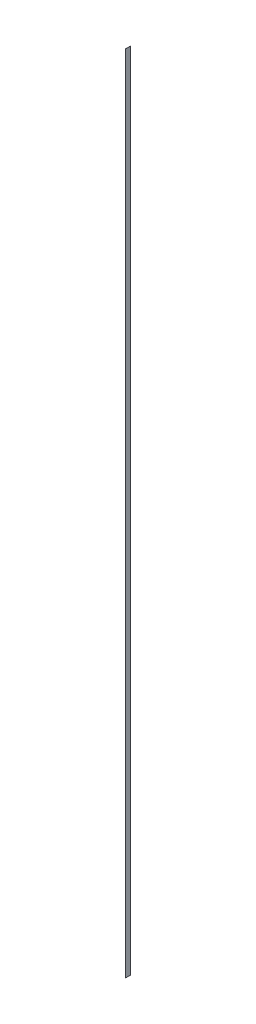
ISO-10303-21;
HEADER;
FILE_DESCRIPTION(('STEP AP214'),'2;1');
FILE_NAME('part.step','',(''),(''),'','','');
FILE_SCHEMA(('AUTOMOTIVE_DESIGN { 1 0 10303 214 1 1 1 1 }'));
ENDSEC;
DATA;
#1=APPLICATION_CONTEXT('core data for automotive mechanical design processes');
#2=APPLICATION_PROTOCOL_DEFINITION('international standard','automotive_design',2000,#1);
#3=PRODUCT_CONTEXT('',#1,'mechanical');
#4=PRODUCT('Part','Part','',(#3));
#5=PRODUCT_RELATED_PRODUCT_CATEGORY('part','',(#4));
#6=PRODUCT_DEFINITION_FORMATION('','',#4);
#7=PRODUCT_DEFINITION_CONTEXT('part definition',#1,'design');
#8=PRODUCT_DEFINITION('design','',#6,#7);
#9=PRODUCT_DEFINITION_SHAPE('','',#8);
#10=(LENGTH_UNIT() NAMED_UNIT(*) SI_UNIT(.MILLI.,.METRE.));
#11=(NAMED_UNIT(*) PLANE_ANGLE_UNIT() SI_UNIT($,.RADIAN.));
#12=(NAMED_UNIT(*) SI_UNIT($,.STERADIAN.) SOLID_ANGLE_UNIT());
#13=UNCERTAINTY_MEASURE_WITH_UNIT(LENGTH_MEASURE(1.E-05),#10,'distance_accuracy_value','');
#14=(GEOMETRIC_REPRESENTATION_CONTEXT(3) GLOBAL_UNCERTAINTY_ASSIGNED_CONTEXT((#13)) GLOBAL_UNIT_ASSIGNED_CONTEXT((#10,
#11,#12)) REPRESENTATION_CONTEXT('',''));
#15=CARTESIAN_POINT('',(0.,0.,0.));
#16=DIRECTION('',(0.,0.,1.));
#17=DIRECTION('',(1.,0.,0.));
#18=AXIS2_PLACEMENT_3D('',#15,#16,#17);
#19=CARTESIAN_POINT('',(1.27,0.,25.4));
#20=DIRECTION('',(0.,0.,-1.));
#21=DIRECTION('',(-1.,0.,0.));
#22=AXIS2_PLACEMENT_3D('',#19,#20,#21);
#23=PLANE('',#22);
#24=DIRECTION('',(0.,-1.,0.));
#25=VECTOR('',#24,1.);
#26=CARTESIAN_POINT('',(0.,0.,25.4));
#27=LINE('',#26,#25);
#28=CARTESIAN_POINT('',(0.,8229.6,25.4));
#29=VERTEX_POINT('',#28);
#30=CARTESIAN_POINT('',(0.,0.,25.4));
#31=VERTEX_POINT('',#30);
#32=EDGE_CURVE('E96',#29,#31,#27,.T.);
#33=ORIENTED_EDGE('',*,*,#32,.T.);
#34=DIRECTION('',(-1.,0.,0.));
#35=VECTOR('',#34,1.);
#36=CARTESIAN_POINT('',(1.27,0.,25.4));
#37=LINE('',#36,#35);
#38=CARTESIAN_POINT('',(1.27,0.,25.4));
#39=VERTEX_POINT('',#38);
#40=EDGE_CURVE('E11',#39,#31,#37,.T.);
#41=ORIENTED_EDGE('',*,*,#40,.F.);
#42=DIRECTION('',(0.,-1.,0.));
#43=VECTOR('',#42,1.);
#44=CARTESIAN_POINT('',(1.27,0.,25.4));
#45=LINE('',#44,#43);
#46=CARTESIAN_POINT('',(1.27,8229.6,25.4));
#47=VERTEX_POINT('',#46);
#48=EDGE_CURVE('E84',#47,#39,#45,.T.);
#49=ORIENTED_EDGE('',*,*,#48,.F.);
#50=DIRECTION('',(-1.,0.,0.));
#51=VECTOR('',#50,1.);
#52=CARTESIAN_POINT('',(1.27,8229.6,25.4));
#53=LINE('',#52,#51);
#54=EDGE_CURVE('E92',#47,#29,#53,.T.);
#55=ORIENTED_EDGE('',*,*,#54,.T.);
#56=EDGE_LOOP('',(#33,#41,#49,#55));
#57=FACE_BOUND('',#56,.T.);
#58=ADVANCED_FACE('F33',(#57),#23,.F.);
#59=CARTESIAN_POINT('',(1.27,0.,25.4));
#60=DIRECTION('',(0.,1.,0.));
#61=DIRECTION('',(0.,0.,1.));
#62=AXIS2_PLACEMENT_3D('',#59,#60,#61);
#63=PLANE('',#62);
#64=DIRECTION('',(0.,0.,-1.));
#65=VECTOR('',#64,1.);
#66=CARTESIAN_POINT('',(0.,0.,25.4));
#67=LINE('',#66,#65);
#68=CARTESIAN_POINT('',(0.,0.,-25.4));
#69=VERTEX_POINT('',#68);
#70=EDGE_CURVE('E88',#31,#69,#67,.T.);
#71=ORIENTED_EDGE('',*,*,#70,.T.);
#72=DIRECTION('',(-1.,0.,0.));
#73=VECTOR('',#72,1.);
#74=CARTESIAN_POINT('',(1.27,0.,-25.4));
#75=LINE('',#74,#73);
#76=CARTESIAN_POINT('',(1.27,0.,-25.4));
#77=VERTEX_POINT('',#76);
#78=EDGE_CURVE('E41',#77,#69,#75,.T.);
#79=ORIENTED_EDGE('',*,*,#78,.F.);
#80=DIRECTION('',(0.,0.,-1.));
#81=VECTOR('',#80,1.);
#82=CARTESIAN_POINT('',(1.27,0.,25.4));
#83=LINE('',#82,#81);
#84=EDGE_CURVE('E79',#39,#77,#83,.T.);
#85=ORIENTED_EDGE('',*,*,#84,.F.);
#86=ORIENTED_EDGE('',*,*,#40,.T.);
#87=EDGE_LOOP('',(#71,#79,#85,#86));
#88=FACE_BOUND('',#87,.T.);
#89=ADVANCED_FACE('F87',(#88),#63,.F.);
#90=CARTESIAN_POINT('',(1.27,0.,-25.4));
#91=DIRECTION('',(0.,0.,1.));
#92=DIRECTION('',(1.,0.,0.));
#93=AXIS2_PLACEMENT_3D('',#90,#91,#92);
#94=PLANE('',#93);
#95=DIRECTION('',(0.,1.,0.));
#96=VECTOR('',#95,1.);
#97=CARTESIAN_POINT('',(0.,0.,-25.4));
#98=LINE('',#97,#96);
#99=CARTESIAN_POINT('',(0.,8229.6,-25.4));
#100=VERTEX_POINT('',#99);
#101=EDGE_CURVE('E66',#69,#100,#98,.T.);
#102=ORIENTED_EDGE('',*,*,#101,.T.);
#103=DIRECTION('',(-1.,0.,0.));
#104=VECTOR('',#103,1.);
#105=CARTESIAN_POINT('',(1.27,8229.6,-25.4));
#106=LINE('',#105,#104);
#107=CARTESIAN_POINT('',(1.27,8229.6,-25.4));
#108=VERTEX_POINT('',#107);
#109=EDGE_CURVE('E89',#108,#100,#106,.T.);
#110=ORIENTED_EDGE('',*,*,#109,.F.);
#111=DIRECTION('',(0.,1.,0.));
#112=VECTOR('',#111,1.);
#113=CARTESIAN_POINT('',(1.27,0.,-25.4));
#114=LINE('',#113,#112);
#115=EDGE_CURVE('E82',#77,#108,#114,.T.);
#116=ORIENTED_EDGE('',*,*,#115,.F.);
#117=ORIENTED_EDGE('',*,*,#78,.T.);
#118=EDGE_LOOP('',(#102,#110,#116,#117));
#119=FACE_BOUND('',#118,.T.);
#120=ADVANCED_FACE('F90',(#119),#94,.F.);
#121=CARTESIAN_POINT('',(1.27,8229.6,25.4));
#122=DIRECTION('',(0.,-1.,0.));
#123=DIRECTION('',(0.,0.,-1.));
#124=AXIS2_PLACEMENT_3D('',#121,#122,#123);
#125=PLANE('',#124);
#126=DIRECTION('',(0.,0.,1.));
#127=VECTOR('',#126,1.);
#128=CARTESIAN_POINT('',(0.,8229.6,25.4));
#129=LINE('',#128,#127);
#130=EDGE_CURVE('E72',#100,#29,#129,.T.);
#131=ORIENTED_EDGE('',*,*,#130,.T.);
#132=ORIENTED_EDGE('',*,*,#54,.F.);
#133=DIRECTION('',(0.,0.,1.));
#134=VECTOR('',#133,1.);
#135=CARTESIAN_POINT('',(1.27,8229.6,25.4));
#136=LINE('',#135,#134);
#137=EDGE_CURVE('E49',#108,#47,#136,.T.);
#138=ORIENTED_EDGE('',*,*,#137,.F.);
#139=ORIENTED_EDGE('',*,*,#109,.T.);
#140=EDGE_LOOP('',(#131,#132,#138,#139));
#141=FACE_BOUND('',#140,.T.);
#142=ADVANCED_FACE('F103',(#141),#125,.F.);
#143=CARTESIAN_POINT('',(1.27,0.,0.));
#144=DIRECTION('',(-1.,0.,0.));
#145=DIRECTION('',(0.,0.,1.));
#146=AXIS2_PLACEMENT_3D('',#143,#144,#145);
#147=PLANE('',#146);
#148=ORIENTED_EDGE('',*,*,#48,.T.);
#149=ORIENTED_EDGE('',*,*,#84,.T.);
#150=ORIENTED_EDGE('',*,*,#115,.T.);
#151=ORIENTED_EDGE('',*,*,#137,.T.);
#152=EDGE_LOOP('',(#148,#149,#150,#151));
#153=FACE_BOUND('',#152,.T.);
#154=ADVANCED_FACE('F80',(#153),#147,.F.);
#155=CARTESIAN_POINT('',(0.,0.,0.));
#156=DIRECTION('',(-1.,0.,0.));
#157=DIRECTION('',(0.,0.,1.));
#158=AXIS2_PLACEMENT_3D('',#155,#156,#157);
#159=PLANE('',#158);
#160=ORIENTED_EDGE('',*,*,#32,.F.);
#161=ORIENTED_EDGE('',*,*,#130,.F.);
#162=ORIENTED_EDGE('',*,*,#101,.F.);
#163=ORIENTED_EDGE('',*,*,#70,.F.);
#164=EDGE_LOOP('',(#160,#161,#162,#163));
#165=FACE_BOUND('',#164,.T.);
#166=ADVANCED_FACE('F106',(#165),#159,.T.);
#167=CLOSED_SHELL('',(#58,#89,#120,#142,#154,#166));
#168=MANIFOLD_SOLID_BREP('B2',#167);
#169=ADVANCED_BREP_SHAPE_REPRESENTATION('',(#18,#168),#14);
#170=SHAPE_DEFINITION_REPRESENTATION(#9,#169);
ENDSEC;
END-ISO-10303-21;
